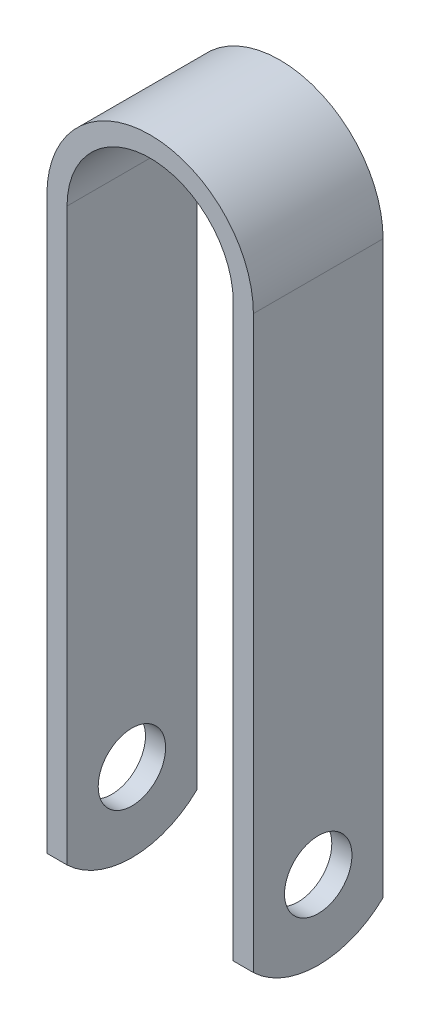
ISO-10303-21;
HEADER;
FILE_DESCRIPTION(('STEP AP214'),'2;1');
FILE_NAME('part.step','',(''),(''),'','','');
FILE_SCHEMA(('AUTOMOTIVE_DESIGN { 1 0 10303 214 1 1 1 1 }'));
ENDSEC;
DATA;
#1=APPLICATION_CONTEXT('core data for automotive mechanical design processes');
#2=APPLICATION_PROTOCOL_DEFINITION('international standard','automotive_design',2000,#1);
#3=PRODUCT_CONTEXT('',#1,'mechanical');
#4=PRODUCT('Part','Part','',(#3));
#5=PRODUCT_RELATED_PRODUCT_CATEGORY('part','',(#4));
#6=PRODUCT_DEFINITION_FORMATION('','',#4);
#7=PRODUCT_DEFINITION_CONTEXT('part definition',#1,'design');
#8=PRODUCT_DEFINITION('design','',#6,#7);
#9=PRODUCT_DEFINITION_SHAPE('','',#8);
#10=(LENGTH_UNIT() NAMED_UNIT(*) SI_UNIT(.MILLI.,.METRE.));
#11=(NAMED_UNIT(*) PLANE_ANGLE_UNIT() SI_UNIT($,.RADIAN.));
#12=(NAMED_UNIT(*) SI_UNIT($,.STERADIAN.) SOLID_ANGLE_UNIT());
#13=UNCERTAINTY_MEASURE_WITH_UNIT(LENGTH_MEASURE(1.E-05),#10,'distance_accuracy_value','');
#14=(GEOMETRIC_REPRESENTATION_CONTEXT(3) GLOBAL_UNCERTAINTY_ASSIGNED_CONTEXT((#13)) GLOBAL_UNIT_ASSIGNED_CONTEXT((#10,
#11,#12)) REPRESENTATION_CONTEXT('',''));
#15=CARTESIAN_POINT('',(0.,0.,0.));
#16=DIRECTION('',(0.,0.,1.));
#17=DIRECTION('',(1.,0.,0.));
#18=AXIS2_PLACEMENT_3D('',#15,#16,#17);
#19=CARTESIAN_POINT('',(2.9845,88.4682,9.6139));
#20=DIRECTION('',(-1.,0.,0.));
#21=DIRECTION('',(0.,0.,1.));
#22=AXIS2_PLACEMENT_3D('',#19,#20,#21);
#23=PLANE('',#22);
#24=CARTESIAN_POINT('',(2.9845,11.63955,0.));
#25=DIRECTION('',(-1.,0.,0.));
#26=DIRECTION('',(0.,0.,1.));
#27=AXIS2_PLACEMENT_3D('',#24,#25,#26);
#28=CIRCLE('',#27,4.99745);
#29=CARTESIAN_POINT('',(2.9845,11.63955,4.99745));
#30=VERTEX_POINT('',#29);
#31=EDGE_CURVE('E165',#30,#30,#28,.T.);
#32=ORIENTED_EDGE('',*,*,#31,.T.);
#33=EDGE_LOOP('',(#32));
#34=FACE_BOUND('',#33,.T.);
#35=CARTESIAN_POINT('',(2.9845,13.867442295082,0.));
#36=DIRECTION('',(-1.,0.,0.));
#37=DIRECTION('',(0.,0.,1.));
#38=AXIS2_PLACEMENT_3D('',#35,#36,#37);
#39=CIRCLE('',#38,13.867442295082);
#40=CARTESIAN_POINT('',(2.9845,3.8735,-9.6139));
#41=VERTEX_POINT('',#40);
#42=CARTESIAN_POINT('',(2.9845,3.8735,9.6139));
#43=VERTEX_POINT('',#42);
#44=EDGE_CURVE('E55',#41,#43,#39,.T.);
#45=ORIENTED_EDGE('',*,*,#44,.F.);
#46=DIRECTION('',(0.,1.,0.));
#47=VECTOR('',#46,1.);
#48=CARTESIAN_POINT('',(2.9845,88.4682,-9.6139));
#49=LINE('',#48,#47);
#50=CARTESIAN_POINT('',(2.9845,88.4682,-9.6139));
#51=VERTEX_POINT('',#50);
#52=EDGE_CURVE('E113',#41,#51,#49,.T.);
#53=ORIENTED_EDGE('',*,*,#52,.T.);
#54=DIRECTION('',(0.,0.,-1.));
#55=VECTOR('',#54,1.);
#56=CARTESIAN_POINT('',(2.9845,88.4682,9.6139));
#57=LINE('',#56,#55);
#58=CARTESIAN_POINT('',(2.9845,88.4682,9.6139));
#59=VERTEX_POINT('',#58);
#60=EDGE_CURVE('E136',#59,#51,#57,.T.);
#61=ORIENTED_EDGE('',*,*,#60,.F.);
#62=DIRECTION('',(0.,1.,0.));
#63=VECTOR('',#62,1.);
#64=CARTESIAN_POINT('',(2.9845,88.4682,9.6139));
#65=LINE('',#64,#63);
#66=EDGE_CURVE('E119',#43,#59,#65,.T.);
#67=ORIENTED_EDGE('',*,*,#66,.F.);
#68=EDGE_LOOP('',(#45,#53,#61,#67));
#69=FACE_BOUND('',#68,.T.);
#70=ADVANCED_FACE('F33',(#34,#69),#23,.F.);
#71=CARTESIAN_POINT('',(27.6225,0.,9.6139));
#72=DIRECTION('',(1.,0.,0.));
#73=DIRECTION('',(0.,0.,-1.));
#74=AXIS2_PLACEMENT_3D('',#71,#72,#73);
#75=PLANE('',#74);
#76=CARTESIAN_POINT('',(27.6225,11.63955,0.));
#77=DIRECTION('',(1.,0.,0.));
#78=DIRECTION('',(0.,0.,-1.));
#79=AXIS2_PLACEMENT_3D('',#76,#77,#78);
#80=CIRCLE('',#79,4.99745);
#81=CARTESIAN_POINT('',(27.6225,11.63955,-4.99745));
#82=VERTEX_POINT('',#81);
#83=EDGE_CURVE('E197',#82,#82,#80,.T.);
#84=ORIENTED_EDGE('',*,*,#83,.T.);
#85=EDGE_LOOP('',(#84));
#86=FACE_BOUND('',#85,.T.);
#87=DIRECTION('',(0.,-1.,0.));
#88=VECTOR('',#87,1.);
#89=CARTESIAN_POINT('',(27.6225,0.,-9.6139));
#90=LINE('',#89,#88);
#91=CARTESIAN_POINT('',(27.6225,88.4682,-9.6139));
#92=VERTEX_POINT('',#91);
#93=CARTESIAN_POINT('',(27.6225,3.8735,-9.6139));
#94=VERTEX_POINT('',#93);
#95=EDGE_CURVE('E150',#92,#94,#90,.T.);
#96=ORIENTED_EDGE('',*,*,#95,.T.);
#97=CARTESIAN_POINT('',(27.6225,13.867442295082,0.));
#98=DIRECTION('',(1.,0.,0.));
#99=DIRECTION('',(0.,0.,-1.));
#100=AXIS2_PLACEMENT_3D('',#97,#98,#99);
#101=CIRCLE('',#100,13.867442295082);
#102=CARTESIAN_POINT('',(27.6225,3.8735,9.6139));
#103=VERTEX_POINT('',#102);
#104=EDGE_CURVE('E140',#103,#94,#101,.T.);
#105=ORIENTED_EDGE('',*,*,#104,.F.);
#106=DIRECTION('',(0.,-1.,0.));
#107=VECTOR('',#106,1.);
#108=CARTESIAN_POINT('',(27.6225,0.,9.6139));
#109=LINE('',#108,#107);
#110=CARTESIAN_POINT('',(27.6225,88.4682,9.6139));
#111=VERTEX_POINT('',#110);
#112=EDGE_CURVE('E148',#111,#103,#109,.T.);
#113=ORIENTED_EDGE('',*,*,#112,.F.);
#114=DIRECTION('',(0.,0.,-1.));
#115=VECTOR('',#114,1.);
#116=CARTESIAN_POINT('',(27.6225,88.4682,9.6139));
#117=LINE('',#116,#115);
#118=EDGE_CURVE('E133',#111,#92,#117,.T.);
#119=ORIENTED_EDGE('',*,*,#118,.T.);
#120=EDGE_LOOP('',(#96,#105,#113,#119));
#121=FACE_BOUND('',#120,.T.);
#122=ADVANCED_FACE('F147',(#86,#121),#75,.F.);
#123=CARTESIAN_POINT('',(30.607,0.,9.6139));
#124=DIRECTION('',(-1.,0.,0.));
#125=DIRECTION('',(0.,0.,1.));
#126=AXIS2_PLACEMENT_3D('',#123,#124,#125);
#127=PLANE('',#126);
#128=CARTESIAN_POINT('',(30.607,11.63955,0.));
#129=DIRECTION('',(-1.,0.,0.));
#130=DIRECTION('',(0.,0.,1.));
#131=AXIS2_PLACEMENT_3D('',#128,#129,#130);
#132=CIRCLE('',#131,4.99745);
#133=CARTESIAN_POINT('',(30.607,11.63955,4.99745));
#134=VERTEX_POINT('',#133);
#135=EDGE_CURVE('E200',#134,#134,#132,.T.);
#136=ORIENTED_EDGE('',*,*,#135,.T.);
#137=EDGE_LOOP('',(#136));
#138=FACE_BOUND('',#137,.T.);
#139=CARTESIAN_POINT('',(30.607,13.867442295082,0.));
#140=DIRECTION('',(1.,0.,0.));
#141=DIRECTION('',(0.,0.,-1.));
#142=AXIS2_PLACEMENT_3D('',#139,#140,#141);
#143=CIRCLE('',#142,13.867442295082);
#144=CARTESIAN_POINT('',(30.607,3.8735,9.6139));
#145=VERTEX_POINT('',#144);
#146=CARTESIAN_POINT('',(30.607,3.8735,-9.6139));
#147=VERTEX_POINT('',#146);
#148=EDGE_CURVE('E47',#145,#147,#143,.T.);
#149=ORIENTED_EDGE('',*,*,#148,.T.);
#150=DIRECTION('',(0.,1.,0.));
#151=VECTOR('',#150,1.);
#152=CARTESIAN_POINT('',(30.607,0.,-9.6139));
#153=LINE('',#152,#151);
#154=CARTESIAN_POINT('',(30.607,88.4682,-9.6139));
#155=VERTEX_POINT('',#154);
#156=EDGE_CURVE('E124',#147,#155,#153,.T.);
#157=ORIENTED_EDGE('',*,*,#156,.T.);
#158=DIRECTION('',(0.,0.,-1.));
#159=VECTOR('',#158,1.);
#160=CARTESIAN_POINT('',(30.607,88.4682,9.6139));
#161=LINE('',#160,#159);
#162=CARTESIAN_POINT('',(30.607,88.4682,9.6139));
#163=VERTEX_POINT('',#162);
#164=EDGE_CURVE('E129',#163,#155,#161,.T.);
#165=ORIENTED_EDGE('',*,*,#164,.F.);
#166=DIRECTION('',(0.,1.,0.));
#167=VECTOR('',#166,1.);
#168=CARTESIAN_POINT('',(30.607,0.,9.6139));
#169=LINE('',#168,#167);
#170=EDGE_CURVE('E155',#145,#163,#169,.T.);
#171=ORIENTED_EDGE('',*,*,#170,.F.);
#172=EDGE_LOOP('',(#149,#157,#165,#171));
#173=FACE_BOUND('',#172,.T.);
#174=ADVANCED_FACE('F169',(#138,#173),#127,.F.);
#175=CARTESIAN_POINT('',(0.,0.,9.6139));
#176=DIRECTION('',(1.,0.,0.));
#177=DIRECTION('',(0.,0.,-1.));
#178=AXIS2_PLACEMENT_3D('',#175,#176,#177);
#179=PLANE('',#178);
#180=CARTESIAN_POINT('',(0.,11.63955,0.));
#181=DIRECTION('',(1.,0.,0.));
#182=DIRECTION('',(0.,0.,-1.));
#183=AXIS2_PLACEMENT_3D('',#180,#181,#182);
#184=CIRCLE('',#183,4.99745);
#185=CARTESIAN_POINT('',(0.,11.63955,-4.99745));
#186=VERTEX_POINT('',#185);
#187=EDGE_CURVE('E205',#186,#186,#184,.T.);
#188=ORIENTED_EDGE('',*,*,#187,.T.);
#189=EDGE_LOOP('',(#188));
#190=FACE_BOUND('',#189,.T.);
#191=DIRECTION('',(0.,-1.,0.));
#192=VECTOR('',#191,1.);
#193=CARTESIAN_POINT('',(0.,0.,-9.6139));
#194=LINE('',#193,#192);
#195=CARTESIAN_POINT('',(0.,88.4682,-9.6139));
#196=VERTEX_POINT('',#195);
#197=CARTESIAN_POINT('',(0.,3.8735,-9.6139));
#198=VERTEX_POINT('',#197);
#199=EDGE_CURVE('E111',#196,#198,#194,.T.);
#200=ORIENTED_EDGE('',*,*,#199,.T.);
#201=CARTESIAN_POINT('',(0.,13.867442295082,0.));
#202=DIRECTION('',(1.,0.,0.));
#203=DIRECTION('',(0.,0.,-1.));
#204=AXIS2_PLACEMENT_3D('',#201,#202,#203);
#205=CIRCLE('',#204,13.867442295082);
#206=CARTESIAN_POINT('',(0.,3.8735,9.6139));
#207=VERTEX_POINT('',#206);
#208=EDGE_CURVE('E95',#207,#198,#205,.T.);
#209=ORIENTED_EDGE('',*,*,#208,.F.);
#210=DIRECTION('',(0.,-1.,0.));
#211=VECTOR('',#210,1.);
#212=CARTESIAN_POINT('',(0.,0.,9.6139));
#213=LINE('',#212,#211);
#214=CARTESIAN_POINT('',(0.,88.4682,9.6139));
#215=VERTEX_POINT('',#214);
#216=EDGE_CURVE('E130',#215,#207,#213,.T.);
#217=ORIENTED_EDGE('',*,*,#216,.F.);
#218=DIRECTION('',(0.,0.,-1.));
#219=VECTOR('',#218,1.);
#220=CARTESIAN_POINT('',(0.,88.4682,9.6139));
#221=LINE('',#220,#219);
#222=EDGE_CURVE('E118',#215,#196,#221,.T.);
#223=ORIENTED_EDGE('',*,*,#222,.T.);
#224=EDGE_LOOP('',(#200,#209,#217,#223));
#225=FACE_BOUND('',#224,.T.);
#226=ADVANCED_FACE('F116',(#190,#225),#179,.F.);
#227=CARTESIAN_POINT('',(15.3035,88.4682,-9.6139));
#228=DIRECTION('',(0.,0.,-1.));
#229=DIRECTION('',(-1.,0.,0.));
#230=AXIS2_PLACEMENT_3D('',#227,#228,#229);
#231=PLANE('',#230);
#232=ORIENTED_EDGE('',*,*,#156,.F.);
#233=DIRECTION('',(1.,0.,0.));
#234=VECTOR('',#233,1.);
#235=CARTESIAN_POINT('',(0.,3.8735,-9.6139));
#236=LINE('',#235,#234);
#237=EDGE_CURVE('E11',#147,#94,#236,.F.);
#238=ORIENTED_EDGE('',*,*,#237,.T.);
#239=ORIENTED_EDGE('',*,*,#95,.F.);
#240=CARTESIAN_POINT('',(15.3035,88.4682,-9.6139));
#241=DIRECTION('',(0.,0.,-1.));
#242=DIRECTION('',(-1.,0.,0.));
#243=AXIS2_PLACEMENT_3D('',#240,#241,#242);
#244=CIRCLE('',#243,12.319);
#245=EDGE_CURVE('E164',#51,#92,#244,.T.);
#246=ORIENTED_EDGE('',*,*,#245,.F.);
#247=ORIENTED_EDGE('',*,*,#52,.F.);
#248=DIRECTION('',(1.,0.,0.));
#249=VECTOR('',#248,1.);
#250=CARTESIAN_POINT('',(0.,3.8735,-9.6139));
#251=LINE('',#250,#249);
#252=EDGE_CURVE('E98',#198,#41,#251,.T.);
#253=ORIENTED_EDGE('',*,*,#252,.F.);
#254=ORIENTED_EDGE('',*,*,#199,.F.);
#255=CARTESIAN_POINT('',(15.3035,88.4682,-9.6139));
#256=DIRECTION('',(0.,0.,1.));
#257=DIRECTION('',(-1.,0.,0.));
#258=AXIS2_PLACEMENT_3D('',#255,#256,#257);
#259=CIRCLE('',#258,15.3035);
#260=EDGE_CURVE('E120',#155,#196,#259,.T.);
#261=ORIENTED_EDGE('',*,*,#260,.F.);
#262=EDGE_LOOP('',(#232,#238,#239,#246,#247,#253,#254,#261));
#263=FACE_BOUND('',#262,.T.);
#264=ADVANCED_FACE('F109',(#263),#231,.T.);
#265=CARTESIAN_POINT('',(15.3035,88.4682,9.6139));
#266=DIRECTION('',(0.,0.,-1.));
#267=DIRECTION('',(-1.,0.,0.));
#268=AXIS2_PLACEMENT_3D('',#265,#266,#267);
#269=PLANE('',#268);
#270=DIRECTION('',(1.,0.,0.));
#271=VECTOR('',#270,1.);
#272=CARTESIAN_POINT('',(0.,3.8735,9.6139));
#273=LINE('',#272,#271);
#274=EDGE_CURVE('E40',#145,#103,#273,.F.);
#275=ORIENTED_EDGE('',*,*,#274,.F.);
#276=ORIENTED_EDGE('',*,*,#170,.T.);
#277=CARTESIAN_POINT('',(15.3035,88.4682,9.6139));
#278=DIRECTION('',(0.,0.,1.));
#279=DIRECTION('',(-1.,0.,0.));
#280=AXIS2_PLACEMENT_3D('',#277,#278,#279);
#281=CIRCLE('',#280,15.3035);
#282=EDGE_CURVE('E157',#163,#215,#281,.T.);
#283=ORIENTED_EDGE('',*,*,#282,.T.);
#284=ORIENTED_EDGE('',*,*,#216,.T.);
#285=DIRECTION('',(1.,0.,0.));
#286=VECTOR('',#285,1.);
#287=CARTESIAN_POINT('',(0.,3.8735,9.6139));
#288=LINE('',#287,#286);
#289=EDGE_CURVE('E100',#207,#43,#288,.T.);
#290=ORIENTED_EDGE('',*,*,#289,.T.);
#291=ORIENTED_EDGE('',*,*,#66,.T.);
#292=CARTESIAN_POINT('',(15.3035,88.4682,9.6139));
#293=DIRECTION('',(0.,0.,-1.));
#294=DIRECTION('',(-1.,0.,0.));
#295=AXIS2_PLACEMENT_3D('',#292,#293,#294);
#296=CIRCLE('',#295,12.319);
#297=EDGE_CURVE('E122',#59,#111,#296,.T.);
#298=ORIENTED_EDGE('',*,*,#297,.T.);
#299=ORIENTED_EDGE('',*,*,#112,.T.);
#300=EDGE_LOOP('',(#275,#276,#283,#284,#290,#291,#298,#299));
#301=FACE_BOUND('',#300,.T.);
#302=ADVANCED_FACE('F152',(#301),#269,.F.);
#303=CARTESIAN_POINT('',(15.3035,88.4682,9.6139));
#304=DIRECTION('',(0.,0.,-1.));
#305=DIRECTION('',(-1.,0.,0.));
#306=AXIS2_PLACEMENT_3D('',#303,#304,#305);
#307=CYLINDRICAL_SURFACE('',#306,12.319);
#308=ORIENTED_EDGE('',*,*,#245,.T.);
#309=ORIENTED_EDGE('',*,*,#118,.F.);
#310=ORIENTED_EDGE('',*,*,#297,.F.);
#311=ORIENTED_EDGE('',*,*,#60,.T.);
#312=EDGE_LOOP('',(#308,#309,#310,#311));
#313=FACE_BOUND('',#312,.T.);
#314=ADVANCED_FACE('F178',(#313),#307,.F.);
#315=CARTESIAN_POINT('',(15.3035,88.4682,9.6139));
#316=DIRECTION('',(0.,0.,-1.));
#317=DIRECTION('',(-1.,0.,0.));
#318=AXIS2_PLACEMENT_3D('',#315,#316,#317);
#319=CYLINDRICAL_SURFACE('',#318,15.3035);
#320=ORIENTED_EDGE('',*,*,#260,.T.);
#321=ORIENTED_EDGE('',*,*,#222,.F.);
#322=ORIENTED_EDGE('',*,*,#282,.F.);
#323=ORIENTED_EDGE('',*,*,#164,.T.);
#324=EDGE_LOOP('',(#320,#321,#322,#323));
#325=FACE_BOUND('',#324,.T.);
#326=ADVANCED_FACE('F172',(#325),#319,.T.);
#327=CARTESIAN_POINT('',(0.,11.63955,0.));
#328=DIRECTION('',(1.,0.,0.));
#329=DIRECTION('',(0.,0.,-1.));
#330=AXIS2_PLACEMENT_3D('',#327,#328,#329);
#331=CYLINDRICAL_SURFACE('',#330,4.99745);
#332=ORIENTED_EDGE('',*,*,#187,.F.);
#333=EDGE_LOOP('',(#332));
#334=FACE_BOUND('',#333,.T.);
#335=ORIENTED_EDGE('',*,*,#31,.F.);
#336=EDGE_LOOP('',(#335));
#337=FACE_BOUND('',#336,.T.);
#338=ADVANCED_FACE('F184',(#334,#337),#331,.F.);
#339=ORIENTED_EDGE('',*,*,#135,.F.);
#340=EDGE_LOOP('',(#339));
#341=FACE_BOUND('',#340,.T.);
#342=ORIENTED_EDGE('',*,*,#83,.F.);
#343=EDGE_LOOP('',(#342));
#344=FACE_BOUND('',#343,.T.);
#345=ADVANCED_FACE('F213',(#341,#344),#331,.F.);
#346=CARTESIAN_POINT('',(0.,13.867442295082,0.));
#347=DIRECTION('',(1.,0.,0.));
#348=DIRECTION('',(0.,0.,-1.));
#349=AXIS2_PLACEMENT_3D('',#346,#347,#348);
#350=CYLINDRICAL_SURFACE('',#349,13.867442295082);
#351=ORIENTED_EDGE('',*,*,#44,.T.);
#352=ORIENTED_EDGE('',*,*,#289,.F.);
#353=ORIENTED_EDGE('',*,*,#208,.T.);
#354=ORIENTED_EDGE('',*,*,#252,.T.);
#355=EDGE_LOOP('',(#351,#352,#353,#354));
#356=FACE_BOUND('',#355,.T.);
#357=ADVANCED_FACE('F97',(#356),#350,.T.);
#358=ORIENTED_EDGE('',*,*,#104,.T.);
#359=ORIENTED_EDGE('',*,*,#237,.F.);
#360=ORIENTED_EDGE('',*,*,#148,.F.);
#361=ORIENTED_EDGE('',*,*,#274,.T.);
#362=EDGE_LOOP('',(#358,#359,#360,#361));
#363=FACE_BOUND('',#362,.T.);
#364=ADVANCED_FACE('F139',(#363),#350,.T.);
#365=CLOSED_SHELL('',(#70,#122,#174,#226,#264,#302,#314,#326,#338,#345,#357,#364));
#366=MANIFOLD_SOLID_BREP('B2',#365);
#367=ADVANCED_BREP_SHAPE_REPRESENTATION('',(#18,#366),#14);
#368=SHAPE_DEFINITION_REPRESENTATION(#9,#367);
ENDSEC;
END-ISO-10303-21;
